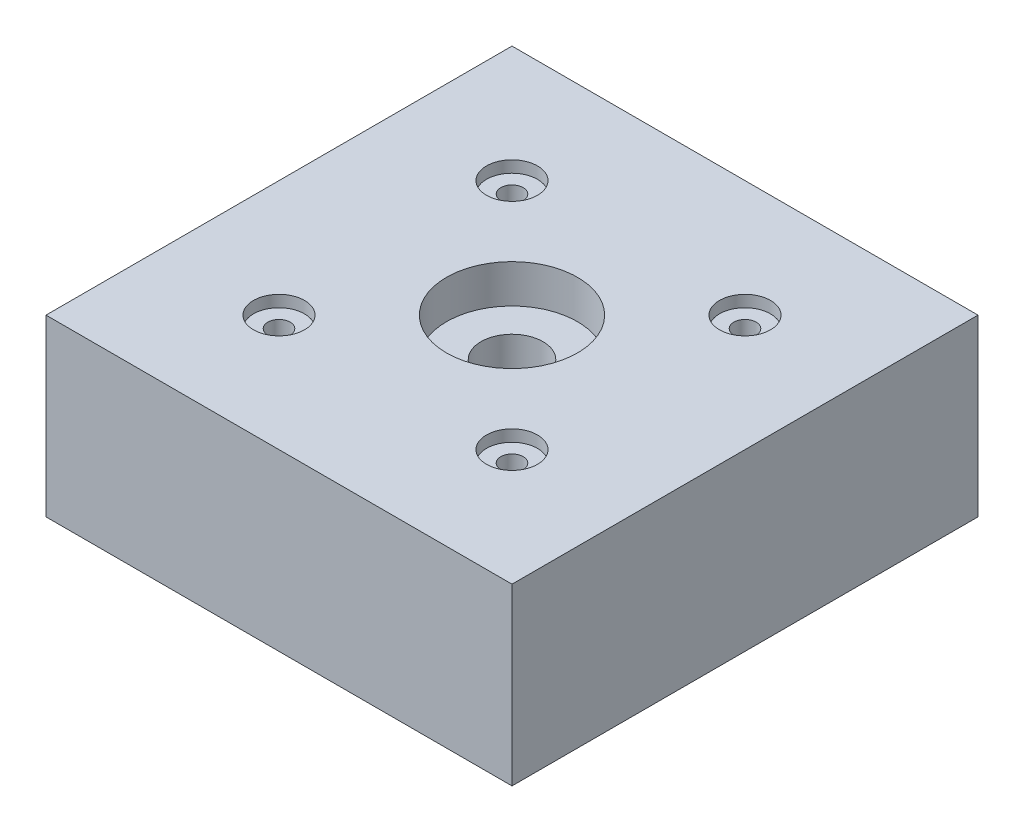
ISO-10303-21;
HEADER;
FILE_DESCRIPTION(('STEP AP214'),'2;1');
FILE_NAME('part.step','',(''),(''),'','','');
FILE_SCHEMA(('AUTOMOTIVE_DESIGN { 1 0 10303 214 1 1 1 1 }'));
ENDSEC;
DATA;
#1=APPLICATION_CONTEXT('core data for automotive mechanical design processes');
#2=APPLICATION_PROTOCOL_DEFINITION('international standard','automotive_design',2000,#1);
#3=PRODUCT_CONTEXT('',#1,'mechanical');
#4=PRODUCT('Part','Part','',(#3));
#5=PRODUCT_RELATED_PRODUCT_CATEGORY('part','',(#4));
#6=PRODUCT_DEFINITION_FORMATION('','',#4);
#7=PRODUCT_DEFINITION_CONTEXT('part definition',#1,'design');
#8=PRODUCT_DEFINITION('design','',#6,#7);
#9=PRODUCT_DEFINITION_SHAPE('','',#8);
#10=(LENGTH_UNIT() NAMED_UNIT(*) SI_UNIT(.MILLI.,.METRE.));
#11=(NAMED_UNIT(*) PLANE_ANGLE_UNIT() SI_UNIT($,.RADIAN.));
#12=(NAMED_UNIT(*) SI_UNIT($,.STERADIAN.) SOLID_ANGLE_UNIT());
#13=UNCERTAINTY_MEASURE_WITH_UNIT(LENGTH_MEASURE(1.E-05),#10,'distance_accuracy_value','');
#14=(GEOMETRIC_REPRESENTATION_CONTEXT(3) GLOBAL_UNCERTAINTY_ASSIGNED_CONTEXT((#13)) GLOBAL_UNIT_ASSIGNED_CONTEXT((#10,
#11,#12)) REPRESENTATION_CONTEXT('',''));
#15=CARTESIAN_POINT('',(0.,0.,0.));
#16=DIRECTION('',(0.,0.,1.));
#17=DIRECTION('',(1.,0.,0.));
#18=AXIS2_PLACEMENT_3D('',#15,#16,#17);
#19=CARTESIAN_POINT('',(-25.4,19.05,25.4));
#20=DIRECTION('',(1.,0.,0.));
#21=DIRECTION('',(0.,0.,-1.));
#22=AXIS2_PLACEMENT_3D('',#19,#20,#21);
#23=PLANE('',#22);
#24=DIRECTION('',(0.,0.,1.));
#25=VECTOR('',#24,1.);
#26=CARTESIAN_POINT('',(-25.4,0.,25.4));
#27=LINE('',#26,#25);
#28=CARTESIAN_POINT('',(-25.4,0.,-25.4));
#29=VERTEX_POINT('',#28);
#30=CARTESIAN_POINT('',(-25.4,0.,25.4));
#31=VERTEX_POINT('',#30);
#32=EDGE_CURVE('E96',#29,#31,#27,.T.);
#33=ORIENTED_EDGE('',*,*,#32,.T.);
#34=DIRECTION('',(0.,-1.,0.));
#35=VECTOR('',#34,1.);
#36=CARTESIAN_POINT('',(-25.4,19.05,25.4));
#37=LINE('',#36,#35);
#38=CARTESIAN_POINT('',(-25.4,19.05,25.4));
#39=VERTEX_POINT('',#38);
#40=EDGE_CURVE('E11',#39,#31,#37,.T.);
#41=ORIENTED_EDGE('',*,*,#40,.F.);
#42=DIRECTION('',(0.,0.,1.));
#43=VECTOR('',#42,1.);
#44=CARTESIAN_POINT('',(-25.4,19.05,25.4));
#45=LINE('',#44,#43);
#46=CARTESIAN_POINT('',(-25.4,19.05,-25.4));
#47=VERTEX_POINT('',#46);
#48=EDGE_CURVE('E84',#47,#39,#45,.T.);
#49=ORIENTED_EDGE('',*,*,#48,.F.);
#50=DIRECTION('',(0.,-1.,0.));
#51=VECTOR('',#50,1.);
#52=CARTESIAN_POINT('',(-25.4,19.05,-25.4));
#53=LINE('',#52,#51);
#54=EDGE_CURVE('E92',#47,#29,#53,.T.);
#55=ORIENTED_EDGE('',*,*,#54,.T.);
#56=EDGE_LOOP('',(#33,#41,#49,#55));
#57=FACE_BOUND('',#56,.T.);
#58=ADVANCED_FACE('F33',(#57),#23,.F.);
#59=CARTESIAN_POINT('',(25.4,19.05,25.4));
#60=DIRECTION('',(0.,0.,-1.));
#61=DIRECTION('',(-1.,0.,0.));
#62=AXIS2_PLACEMENT_3D('',#59,#60,#61);
#63=PLANE('',#62);
#64=DIRECTION('',(1.,0.,0.));
#65=VECTOR('',#64,1.);
#66=CARTESIAN_POINT('',(25.4,0.,25.4));
#67=LINE('',#66,#65);
#68=CARTESIAN_POINT('',(25.4,0.,25.4));
#69=VERTEX_POINT('',#68);
#70=EDGE_CURVE('E88',#31,#69,#67,.T.);
#71=ORIENTED_EDGE('',*,*,#70,.T.);
#72=DIRECTION('',(0.,-1.,0.));
#73=VECTOR('',#72,1.);
#74=CARTESIAN_POINT('',(25.4,19.05,25.4));
#75=LINE('',#74,#73);
#76=CARTESIAN_POINT('',(25.4,19.05,25.4));
#77=VERTEX_POINT('',#76);
#78=EDGE_CURVE('E41',#77,#69,#75,.T.);
#79=ORIENTED_EDGE('',*,*,#78,.F.);
#80=DIRECTION('',(1.,0.,0.));
#81=VECTOR('',#80,1.);
#82=CARTESIAN_POINT('',(25.4,19.05,25.4));
#83=LINE('',#82,#81);
#84=EDGE_CURVE('E79',#39,#77,#83,.T.);
#85=ORIENTED_EDGE('',*,*,#84,.F.);
#86=ORIENTED_EDGE('',*,*,#40,.T.);
#87=EDGE_LOOP('',(#71,#79,#85,#86));
#88=FACE_BOUND('',#87,.T.);
#89=ADVANCED_FACE('F87',(#88),#63,.F.);
#90=CARTESIAN_POINT('',(25.4,19.05,25.4));
#91=DIRECTION('',(-1.,0.,0.));
#92=DIRECTION('',(0.,0.,1.));
#93=AXIS2_PLACEMENT_3D('',#90,#91,#92);
#94=PLANE('',#93);
#95=DIRECTION('',(0.,0.,-1.));
#96=VECTOR('',#95,1.);
#97=CARTESIAN_POINT('',(25.4,0.,25.4));
#98=LINE('',#97,#96);
#99=CARTESIAN_POINT('',(25.4,0.,-25.4));
#100=VERTEX_POINT('',#99);
#101=EDGE_CURVE('E66',#69,#100,#98,.T.);
#102=ORIENTED_EDGE('',*,*,#101,.T.);
#103=DIRECTION('',(0.,-1.,0.));
#104=VECTOR('',#103,1.);
#105=CARTESIAN_POINT('',(25.4,19.05,-25.4));
#106=LINE('',#105,#104);
#107=CARTESIAN_POINT('',(25.4,19.05,-25.4));
#108=VERTEX_POINT('',#107);
#109=EDGE_CURVE('E89',#108,#100,#106,.T.);
#110=ORIENTED_EDGE('',*,*,#109,.F.);
#111=DIRECTION('',(0.,0.,-1.));
#112=VECTOR('',#111,1.);
#113=CARTESIAN_POINT('',(25.4,19.05,25.4));
#114=LINE('',#113,#112);
#115=EDGE_CURVE('E82',#77,#108,#114,.T.);
#116=ORIENTED_EDGE('',*,*,#115,.F.);
#117=ORIENTED_EDGE('',*,*,#78,.T.);
#118=EDGE_LOOP('',(#102,#110,#116,#117));
#119=FACE_BOUND('',#118,.T.);
#120=ADVANCED_FACE('F90',(#119),#94,.F.);
#121=CARTESIAN_POINT('',(25.4,19.05,-25.4));
#122=DIRECTION('',(0.,0.,1.));
#123=DIRECTION('',(1.,0.,0.));
#124=AXIS2_PLACEMENT_3D('',#121,#122,#123);
#125=PLANE('',#124);
#126=DIRECTION('',(-1.,0.,0.));
#127=VECTOR('',#126,1.);
#128=CARTESIAN_POINT('',(25.4,0.,-25.4));
#129=LINE('',#128,#127);
#130=EDGE_CURVE('E72',#100,#29,#129,.T.);
#131=ORIENTED_EDGE('',*,*,#130,.T.);
#132=ORIENTED_EDGE('',*,*,#54,.F.);
#133=DIRECTION('',(-1.,0.,0.));
#134=VECTOR('',#133,1.);
#135=CARTESIAN_POINT('',(25.4,19.05,-25.4));
#136=LINE('',#135,#134);
#137=EDGE_CURVE('E49',#108,#47,#136,.T.);
#138=ORIENTED_EDGE('',*,*,#137,.F.);
#139=ORIENTED_EDGE('',*,*,#109,.T.);
#140=EDGE_LOOP('',(#131,#132,#138,#139));
#141=FACE_BOUND('',#140,.T.);
#142=ADVANCED_FACE('F104',(#141),#125,.F.);
#143=CARTESIAN_POINT('',(0.,19.05,0.));
#144=DIRECTION('',(0.,1.,0.));
#145=DIRECTION('',(0.,0.,1.));
#146=AXIS2_PLACEMENT_3D('',#143,#144,#145);
#147=PLANE('',#146);
#148=CARTESIAN_POINT('',(12.7,19.05,-12.7));
#149=DIRECTION('',(0.,1.,0.));
#150=DIRECTION('',(0.,0.,1.));
#151=AXIS2_PLACEMENT_3D('',#148,#149,#150);
#152=CIRCLE('',#151,2.77875999999999);
#153=CARTESIAN_POINT('',(12.7,19.05,-9.92124));
#154=VERTEX_POINT('',#153);
#155=EDGE_CURVE('E166',#154,#154,#152,.T.);
#156=ORIENTED_EDGE('',*,*,#155,.F.);
#157=EDGE_LOOP('',(#156));
#158=FACE_BOUND('',#157,.T.);
#159=CARTESIAN_POINT('',(-12.7,19.05,12.7));
#160=DIRECTION('',(0.,1.,0.));
#161=DIRECTION('',(0.,0.,1.));
#162=AXIS2_PLACEMENT_3D('',#159,#160,#161);
#163=CIRCLE('',#162,2.77875999999999);
#164=CARTESIAN_POINT('',(-12.7,19.05,15.47876));
#165=VERTEX_POINT('',#164);
#166=EDGE_CURVE('E154',#165,#165,#163,.T.);
#167=ORIENTED_EDGE('',*,*,#166,.F.);
#168=EDGE_LOOP('',(#167));
#169=FACE_BOUND('',#168,.T.);
#170=CARTESIAN_POINT('',(12.7,19.05,12.7));
#171=DIRECTION('',(0.,1.,0.));
#172=DIRECTION('',(0.,0.,1.));
#173=AXIS2_PLACEMENT_3D('',#170,#171,#172);
#174=CIRCLE('',#173,2.77875999999999);
#175=CARTESIAN_POINT('',(12.7,19.05,15.47876));
#176=VERTEX_POINT('',#175);
#177=EDGE_CURVE('E142',#176,#176,#174,.T.);
#178=ORIENTED_EDGE('',*,*,#177,.F.);
#179=EDGE_LOOP('',(#178));
#180=FACE_BOUND('',#179,.T.);
#181=CARTESIAN_POINT('',(-12.7,19.05,-12.7));
#182=DIRECTION('',(0.,1.,0.));
#183=DIRECTION('',(0.,0.,1.));
#184=AXIS2_PLACEMENT_3D('',#181,#182,#183);
#185=CIRCLE('',#184,2.77875999999999);
#186=CARTESIAN_POINT('',(-12.7,19.05,-9.92124));
#187=VERTEX_POINT('',#186);
#188=EDGE_CURVE('E130',#187,#187,#185,.T.);
#189=ORIENTED_EDGE('',*,*,#188,.F.);
#190=EDGE_LOOP('',(#189));
#191=FACE_BOUND('',#190,.T.);
#192=CARTESIAN_POINT('',(0.,19.05,0.));
#193=DIRECTION('',(0.,1.,0.));
#194=DIRECTION('',(0.,0.,1.));
#195=AXIS2_PLACEMENT_3D('',#192,#193,#194);
#196=CIRCLE('',#195,7.14375);
#197=CARTESIAN_POINT('',(0.,19.05,7.14375));
#198=VERTEX_POINT('',#197);
#199=EDGE_CURVE('E118',#198,#198,#196,.T.);
#200=ORIENTED_EDGE('',*,*,#199,.F.);
#201=EDGE_LOOP('',(#200));
#202=FACE_BOUND('',#201,.T.);
#203=ORIENTED_EDGE('',*,*,#48,.T.);
#204=ORIENTED_EDGE('',*,*,#84,.T.);
#205=ORIENTED_EDGE('',*,*,#115,.T.);
#206=ORIENTED_EDGE('',*,*,#137,.T.);
#207=EDGE_LOOP('',(#203,#204,#205,#206));
#208=FACE_BOUND('',#207,.T.);
#209=ADVANCED_FACE('F80',(#158,#169,#180,#191,#202,#208),#147,.T.);
#210=CARTESIAN_POINT('',(0.,0.,0.));
#211=DIRECTION('',(0.,1.,0.));
#212=DIRECTION('',(0.,0.,1.));
#213=AXIS2_PLACEMENT_3D('',#210,#211,#212);
#214=PLANE('',#213);
#215=CARTESIAN_POINT('',(12.7,0.,-12.7));
#216=DIRECTION('',(0.,1.,0.));
#217=DIRECTION('',(0.,0.,1.));
#218=AXIS2_PLACEMENT_3D('',#215,#216,#217);
#219=CIRCLE('',#218,1.21920000000001);
#220=CARTESIAN_POINT('',(12.7,0.,-11.4808));
#221=VERTEX_POINT('',#220);
#222=EDGE_CURVE('E157',#221,#221,#219,.T.);
#223=ORIENTED_EDGE('',*,*,#222,.T.);
#224=EDGE_LOOP('',(#223));
#225=FACE_BOUND('',#224,.T.);
#226=CARTESIAN_POINT('',(-12.7,0.,12.7));
#227=DIRECTION('',(0.,1.,0.));
#228=DIRECTION('',(0.,0.,1.));
#229=AXIS2_PLACEMENT_3D('',#226,#227,#228);
#230=CIRCLE('',#229,1.21920000000001);
#231=CARTESIAN_POINT('',(-12.7,0.,13.9192));
#232=VERTEX_POINT('',#231);
#233=EDGE_CURVE('E145',#232,#232,#230,.T.);
#234=ORIENTED_EDGE('',*,*,#233,.T.);
#235=EDGE_LOOP('',(#234));
#236=FACE_BOUND('',#235,.T.);
#237=CARTESIAN_POINT('',(12.7,0.,12.7));
#238=DIRECTION('',(0.,1.,0.));
#239=DIRECTION('',(0.,0.,1.));
#240=AXIS2_PLACEMENT_3D('',#237,#238,#239);
#241=CIRCLE('',#240,1.21920000000001);
#242=CARTESIAN_POINT('',(12.7,0.,13.9192));
#243=VERTEX_POINT('',#242);
#244=EDGE_CURVE('E133',#243,#243,#241,.T.);
#245=ORIENTED_EDGE('',*,*,#244,.T.);
#246=EDGE_LOOP('',(#245));
#247=FACE_BOUND('',#246,.T.);
#248=CARTESIAN_POINT('',(-12.7,0.,-12.7));
#249=DIRECTION('',(0.,1.,0.));
#250=DIRECTION('',(0.,0.,1.));
#251=AXIS2_PLACEMENT_3D('',#248,#249,#250);
#252=CIRCLE('',#251,1.21920000000001);
#253=CARTESIAN_POINT('',(-12.7,0.,-11.4808));
#254=VERTEX_POINT('',#253);
#255=EDGE_CURVE('E121',#254,#254,#252,.T.);
#256=ORIENTED_EDGE('',*,*,#255,.T.);
#257=EDGE_LOOP('',(#256));
#258=FACE_BOUND('',#257,.T.);
#259=CARTESIAN_POINT('',(0.,0.,0.));
#260=DIRECTION('',(0.,1.,0.));
#261=DIRECTION('',(0.,0.,1.));
#262=AXIS2_PLACEMENT_3D('',#259,#260,#261);
#263=CIRCLE('',#262,3.3782);
#264=CARTESIAN_POINT('',(0.,0.,3.3782));
#265=VERTEX_POINT('',#264);
#266=EDGE_CURVE('E99',#265,#265,#263,.T.);
#267=ORIENTED_EDGE('',*,*,#266,.T.);
#268=EDGE_LOOP('',(#267));
#269=FACE_BOUND('',#268,.T.);
#270=ORIENTED_EDGE('',*,*,#32,.F.);
#271=ORIENTED_EDGE('',*,*,#130,.F.);
#272=ORIENTED_EDGE('',*,*,#101,.F.);
#273=ORIENTED_EDGE('',*,*,#70,.F.);
#274=EDGE_LOOP('',(#270,#271,#272,#273));
#275=FACE_BOUND('',#274,.T.);
#276=ADVANCED_FACE('F107',(#225,#236,#247,#258,#269,#275),#214,.F.);
#277=CARTESIAN_POINT('',(0.,19.05,0.));
#278=DIRECTION('',(0.,1.,0.));
#279=DIRECTION('',(0.,0.,1.));
#280=AXIS2_PLACEMENT_3D('',#277,#278,#279);
#281=CYLINDRICAL_SURFACE('',#280,3.3782);
#282=ORIENTED_EDGE('',*,*,#266,.F.);
#283=EDGE_LOOP('',(#282));
#284=FACE_BOUND('',#283,.T.);
#285=CARTESIAN_POINT('',(0.,14.859,0.));
#286=DIRECTION('',(0.,1.,0.));
#287=DIRECTION('',(0.,0.,1.));
#288=AXIS2_PLACEMENT_3D('',#285,#286,#287);
#289=CIRCLE('',#288,3.37820000000001);
#290=CARTESIAN_POINT('',(0.,14.859,3.37820000000001));
#291=VERTEX_POINT('',#290);
#292=EDGE_CURVE('E112',#291,#291,#289,.T.);
#293=ORIENTED_EDGE('',*,*,#292,.T.);
#294=EDGE_LOOP('',(#293));
#295=FACE_BOUND('',#294,.T.);
#296=ADVANCED_FACE('F196',(#284,#295),#281,.F.);
#297=CARTESIAN_POINT('',(3.37820000000001,14.859,0.));
#298=DIRECTION('',(0.,-1.,0.));
#299=DIRECTION('',(0.,0.,-1.));
#300=AXIS2_PLACEMENT_3D('',#297,#298,#299);
#301=PLANE('',#300);
#302=ORIENTED_EDGE('',*,*,#292,.F.);
#303=EDGE_LOOP('',(#302));
#304=FACE_BOUND('',#303,.T.);
#305=CARTESIAN_POINT('',(0.,14.859,0.));
#306=DIRECTION('',(0.,1.,0.));
#307=DIRECTION('',(0.,0.,1.));
#308=AXIS2_PLACEMENT_3D('',#305,#306,#307);
#309=CIRCLE('',#308,7.14375);
#310=CARTESIAN_POINT('',(0.,14.859,7.14375));
#311=VERTEX_POINT('',#310);
#312=EDGE_CURVE('E115',#311,#311,#309,.T.);
#313=ORIENTED_EDGE('',*,*,#312,.T.);
#314=EDGE_LOOP('',(#313));
#315=FACE_BOUND('',#314,.T.);
#316=ADVANCED_FACE('F186',(#304,#315),#301,.F.);
#317=CARTESIAN_POINT('',(0.,19.05,0.));
#318=DIRECTION('',(0.,1.,0.));
#319=DIRECTION('',(0.,0.,1.));
#320=AXIS2_PLACEMENT_3D('',#317,#318,#319);
#321=CYLINDRICAL_SURFACE('',#320,7.14375);
#322=ORIENTED_EDGE('',*,*,#312,.F.);
#323=EDGE_LOOP('',(#322));
#324=FACE_BOUND('',#323,.T.);
#325=ORIENTED_EDGE('',*,*,#199,.T.);
#326=EDGE_LOOP('',(#325));
#327=FACE_BOUND('',#326,.T.);
#328=ADVANCED_FACE('F183',(#324,#327),#321,.F.);
#329=CARTESIAN_POINT('',(-12.7,19.05,-12.7));
#330=DIRECTION('',(0.,1.,0.));
#331=DIRECTION('',(0.,0.,1.));
#332=AXIS2_PLACEMENT_3D('',#329,#330,#331);
#333=CYLINDRICAL_SURFACE('',#332,1.21920000000001);
#334=ORIENTED_EDGE('',*,*,#255,.F.);
#335=EDGE_LOOP('',(#334));
#336=FACE_BOUND('',#335,.T.);
#337=CARTESIAN_POINT('',(-12.7,17.78,-12.7));
#338=DIRECTION('',(0.,1.,0.));
#339=DIRECTION('',(0.,0.,1.));
#340=AXIS2_PLACEMENT_3D('',#337,#338,#339);
#341=CIRCLE('',#340,1.21920000000001);
#342=CARTESIAN_POINT('',(-12.7,17.78,-11.4808));
#343=VERTEX_POINT('',#342);
#344=EDGE_CURVE('E124',#343,#343,#341,.T.);
#345=ORIENTED_EDGE('',*,*,#344,.T.);
#346=EDGE_LOOP('',(#345));
#347=FACE_BOUND('',#346,.T.);
#348=ADVANCED_FACE('F185',(#336,#347),#333,.F.);
#349=CARTESIAN_POINT('',(-11.4808,17.78,-12.7));
#350=DIRECTION('',(0.,-1.,0.));
#351=DIRECTION('',(0.,0.,-1.));
#352=AXIS2_PLACEMENT_3D('',#349,#350,#351);
#353=PLANE('',#352);
#354=ORIENTED_EDGE('',*,*,#344,.F.);
#355=EDGE_LOOP('',(#354));
#356=FACE_BOUND('',#355,.T.);
#357=CARTESIAN_POINT('',(-12.7,17.78,-12.7));
#358=DIRECTION('',(0.,1.,0.));
#359=DIRECTION('',(0.,0.,1.));
#360=AXIS2_PLACEMENT_3D('',#357,#358,#359);
#361=CIRCLE('',#360,2.77875999999999);
#362=CARTESIAN_POINT('',(-12.7,17.78,-9.92124));
#363=VERTEX_POINT('',#362);
#364=EDGE_CURVE('E127',#363,#363,#361,.T.);
#365=ORIENTED_EDGE('',*,*,#364,.T.);
#366=EDGE_LOOP('',(#365));
#367=FACE_BOUND('',#366,.T.);
#368=ADVANCED_FACE('F193',(#356,#367),#353,.F.);
#369=CARTESIAN_POINT('',(-12.7,19.05,-12.7));
#370=DIRECTION('',(0.,1.,0.));
#371=DIRECTION('',(0.,0.,1.));
#372=AXIS2_PLACEMENT_3D('',#369,#370,#371);
#373=CYLINDRICAL_SURFACE('',#372,2.77875999999999);
#374=ORIENTED_EDGE('',*,*,#364,.F.);
#375=EDGE_LOOP('',(#374));
#376=FACE_BOUND('',#375,.T.);
#377=ORIENTED_EDGE('',*,*,#188,.T.);
#378=EDGE_LOOP('',(#377));
#379=FACE_BOUND('',#378,.T.);
#380=ADVANCED_FACE('F249',(#376,#379),#373,.F.);
#381=CARTESIAN_POINT('',(12.7,19.05,12.7));
#382=DIRECTION('',(0.,1.,0.));
#383=DIRECTION('',(0.,0.,1.));
#384=AXIS2_PLACEMENT_3D('',#381,#382,#383);
#385=CYLINDRICAL_SURFACE('',#384,1.21920000000001);
#386=ORIENTED_EDGE('',*,*,#244,.F.);
#387=EDGE_LOOP('',(#386));
#388=FACE_BOUND('',#387,.T.);
#389=CARTESIAN_POINT('',(12.7,17.78,12.7));
#390=DIRECTION('',(0.,1.,0.));
#391=DIRECTION('',(0.,0.,1.));
#392=AXIS2_PLACEMENT_3D('',#389,#390,#391);
#393=CIRCLE('',#392,1.21920000000001);
#394=CARTESIAN_POINT('',(12.7,17.78,13.9192));
#395=VERTEX_POINT('',#394);
#396=EDGE_CURVE('E136',#395,#395,#393,.T.);
#397=ORIENTED_EDGE('',*,*,#396,.T.);
#398=EDGE_LOOP('',(#397));
#399=FACE_BOUND('',#398,.T.);
#400=ADVANCED_FACE('F259',(#388,#399),#385,.F.);
#401=CARTESIAN_POINT('',(13.9192,17.78,12.7));
#402=DIRECTION('',(0.,-1.,0.));
#403=DIRECTION('',(0.,0.,-1.));
#404=AXIS2_PLACEMENT_3D('',#401,#402,#403);
#405=PLANE('',#404);
#406=ORIENTED_EDGE('',*,*,#396,.F.);
#407=EDGE_LOOP('',(#406));
#408=FACE_BOUND('',#407,.T.);
#409=CARTESIAN_POINT('',(12.7,17.78,12.7));
#410=DIRECTION('',(0.,1.,0.));
#411=DIRECTION('',(0.,0.,1.));
#412=AXIS2_PLACEMENT_3D('',#409,#410,#411);
#413=CIRCLE('',#412,2.77875999999999);
#414=CARTESIAN_POINT('',(12.7,17.78,15.47876));
#415=VERTEX_POINT('',#414);
#416=EDGE_CURVE('E139',#415,#415,#413,.T.);
#417=ORIENTED_EDGE('',*,*,#416,.T.);
#418=EDGE_LOOP('',(#417));
#419=FACE_BOUND('',#418,.T.);
#420=ADVANCED_FACE('F280',(#408,#419),#405,.F.);
#421=CARTESIAN_POINT('',(12.7,19.05,12.7));
#422=DIRECTION('',(0.,1.,0.));
#423=DIRECTION('',(0.,0.,1.));
#424=AXIS2_PLACEMENT_3D('',#421,#422,#423);
#425=CYLINDRICAL_SURFACE('',#424,2.77875999999999);
#426=ORIENTED_EDGE('',*,*,#416,.F.);
#427=EDGE_LOOP('',(#426));
#428=FACE_BOUND('',#427,.T.);
#429=ORIENTED_EDGE('',*,*,#177,.T.);
#430=EDGE_LOOP('',(#429));
#431=FACE_BOUND('',#430,.T.);
#432=ADVANCED_FACE('F290',(#428,#431),#425,.F.);
#433=CARTESIAN_POINT('',(-12.7,19.05,12.7));
#434=DIRECTION('',(0.,1.,0.));
#435=DIRECTION('',(0.,0.,1.));
#436=AXIS2_PLACEMENT_3D('',#433,#434,#435);
#437=CYLINDRICAL_SURFACE('',#436,1.21920000000001);
#438=ORIENTED_EDGE('',*,*,#233,.F.);
#439=EDGE_LOOP('',(#438));
#440=FACE_BOUND('',#439,.T.);
#441=CARTESIAN_POINT('',(-12.7,17.78,12.7));
#442=DIRECTION('',(0.,1.,0.));
#443=DIRECTION('',(0.,0.,1.));
#444=AXIS2_PLACEMENT_3D('',#441,#442,#443);
#445=CIRCLE('',#444,1.21920000000001);
#446=CARTESIAN_POINT('',(-12.7,17.78,13.9192));
#447=VERTEX_POINT('',#446);
#448=EDGE_CURVE('E148',#447,#447,#445,.T.);
#449=ORIENTED_EDGE('',*,*,#448,.T.);
#450=EDGE_LOOP('',(#449));
#451=FACE_BOUND('',#450,.T.);
#452=ADVANCED_FACE('F300',(#440,#451),#437,.F.);
#453=CARTESIAN_POINT('',(-11.4808,17.78,12.7));
#454=DIRECTION('',(0.,-1.,0.));
#455=DIRECTION('',(0.,0.,-1.));
#456=AXIS2_PLACEMENT_3D('',#453,#454,#455);
#457=PLANE('',#456);
#458=ORIENTED_EDGE('',*,*,#448,.F.);
#459=EDGE_LOOP('',(#458));
#460=FACE_BOUND('',#459,.T.);
#461=CARTESIAN_POINT('',(-12.7,17.78,12.7));
#462=DIRECTION('',(0.,1.,0.));
#463=DIRECTION('',(0.,0.,1.));
#464=AXIS2_PLACEMENT_3D('',#461,#462,#463);
#465=CIRCLE('',#464,2.77875999999999);
#466=CARTESIAN_POINT('',(-12.7,17.78,15.47876));
#467=VERTEX_POINT('',#466);
#468=EDGE_CURVE('E151',#467,#467,#465,.T.);
#469=ORIENTED_EDGE('',*,*,#468,.T.);
#470=EDGE_LOOP('',(#469));
#471=FACE_BOUND('',#470,.T.);
#472=ADVANCED_FACE('F310',(#460,#471),#457,.F.);
#473=CARTESIAN_POINT('',(-12.7,19.05,12.7));
#474=DIRECTION('',(0.,1.,0.));
#475=DIRECTION('',(0.,0.,1.));
#476=AXIS2_PLACEMENT_3D('',#473,#474,#475);
#477=CYLINDRICAL_SURFACE('',#476,2.77875999999999);
#478=ORIENTED_EDGE('',*,*,#468,.F.);
#479=EDGE_LOOP('',(#478));
#480=FACE_BOUND('',#479,.T.);
#481=ORIENTED_EDGE('',*,*,#166,.T.);
#482=EDGE_LOOP('',(#481));
#483=FACE_BOUND('',#482,.T.);
#484=ADVANCED_FACE('F320',(#480,#483),#477,.F.);
#485=CARTESIAN_POINT('',(12.7,19.05,-12.7));
#486=DIRECTION('',(0.,1.,0.));
#487=DIRECTION('',(0.,0.,1.));
#488=AXIS2_PLACEMENT_3D('',#485,#486,#487);
#489=CYLINDRICAL_SURFACE('',#488,1.21920000000001);
#490=ORIENTED_EDGE('',*,*,#222,.F.);
#491=EDGE_LOOP('',(#490));
#492=FACE_BOUND('',#491,.T.);
#493=CARTESIAN_POINT('',(12.7,17.78,-12.7));
#494=DIRECTION('',(0.,1.,0.));
#495=DIRECTION('',(0.,0.,1.));
#496=AXIS2_PLACEMENT_3D('',#493,#494,#495);
#497=CIRCLE('',#496,1.21920000000001);
#498=CARTESIAN_POINT('',(12.7,17.78,-11.4808));
#499=VERTEX_POINT('',#498);
#500=EDGE_CURVE('E160',#499,#499,#497,.T.);
#501=ORIENTED_EDGE('',*,*,#500,.T.);
#502=EDGE_LOOP('',(#501));
#503=FACE_BOUND('',#502,.T.);
#504=ADVANCED_FACE('F330',(#492,#503),#489,.F.);
#505=CARTESIAN_POINT('',(13.9192,17.78,-12.7));
#506=DIRECTION('',(0.,-1.,0.));
#507=DIRECTION('',(0.,0.,-1.));
#508=AXIS2_PLACEMENT_3D('',#505,#506,#507);
#509=PLANE('',#508);
#510=ORIENTED_EDGE('',*,*,#500,.F.);
#511=EDGE_LOOP('',(#510));
#512=FACE_BOUND('',#511,.T.);
#513=CARTESIAN_POINT('',(12.7,17.78,-12.7));
#514=DIRECTION('',(0.,1.,0.));
#515=DIRECTION('',(0.,0.,1.));
#516=AXIS2_PLACEMENT_3D('',#513,#514,#515);
#517=CIRCLE('',#516,2.77875999999999);
#518=CARTESIAN_POINT('',(12.7,17.78,-9.92124));
#519=VERTEX_POINT('',#518);
#520=EDGE_CURVE('E163',#519,#519,#517,.T.);
#521=ORIENTED_EDGE('',*,*,#520,.T.);
#522=EDGE_LOOP('',(#521));
#523=FACE_BOUND('',#522,.T.);
#524=ADVANCED_FACE('F340',(#512,#523),#509,.F.);
#525=CARTESIAN_POINT('',(12.7,19.05,-12.7));
#526=DIRECTION('',(0.,1.,0.));
#527=DIRECTION('',(0.,0.,1.));
#528=AXIS2_PLACEMENT_3D('',#525,#526,#527);
#529=CYLINDRICAL_SURFACE('',#528,2.77875999999999);
#530=ORIENTED_EDGE('',*,*,#520,.F.);
#531=EDGE_LOOP('',(#530));
#532=FACE_BOUND('',#531,.T.);
#533=ORIENTED_EDGE('',*,*,#155,.T.);
#534=EDGE_LOOP('',(#533));
#535=FACE_BOUND('',#534,.T.);
#536=ADVANCED_FACE('F170',(#532,#535),#529,.F.);
#537=CLOSED_SHELL('',(#58,#89,#120,#142,#209,#276,#296,#316,#328,#348,#368,#380,#400,#420,#432,
#452,#472,#484,#504,#524,#536));
#538=MANIFOLD_SOLID_BREP('B2',#537);
#539=ADVANCED_BREP_SHAPE_REPRESENTATION('',(#18,#538),#14);
#540=SHAPE_DEFINITION_REPRESENTATION(#9,#539);
ENDSEC;
END-ISO-10303-21;
